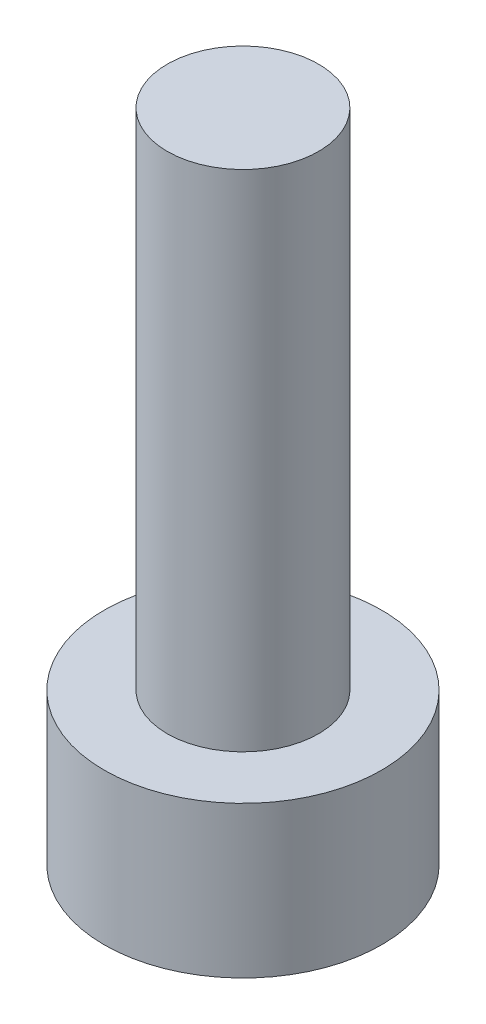
ISO-10303-21;
HEADER;
FILE_DESCRIPTION(('STEP AP214'),'2;1');
FILE_NAME('part.step','',(''),(''),'','','');
FILE_SCHEMA(('AUTOMOTIVE_DESIGN { 1 0 10303 214 1 1 1 1 }'));
ENDSEC;
DATA;
#1=APPLICATION_CONTEXT('core data for automotive mechanical design processes');
#2=APPLICATION_PROTOCOL_DEFINITION('international standard','automotive_design',2000,#1);
#3=PRODUCT_CONTEXT('',#1,'mechanical');
#4=PRODUCT('Part','Part','',(#3));
#5=PRODUCT_RELATED_PRODUCT_CATEGORY('part','',(#4));
#6=PRODUCT_DEFINITION_FORMATION('','',#4);
#7=PRODUCT_DEFINITION_CONTEXT('part definition',#1,'design');
#8=PRODUCT_DEFINITION('design','',#6,#7);
#9=PRODUCT_DEFINITION_SHAPE('','',#8);
#10=(LENGTH_UNIT() NAMED_UNIT(*) SI_UNIT(.MILLI.,.METRE.));
#11=(NAMED_UNIT(*) PLANE_ANGLE_UNIT() SI_UNIT($,.RADIAN.));
#12=(NAMED_UNIT(*) SI_UNIT($,.STERADIAN.) SOLID_ANGLE_UNIT());
#13=UNCERTAINTY_MEASURE_WITH_UNIT(LENGTH_MEASURE(1.E-05),#10,'distance_accuracy_value','');
#14=(GEOMETRIC_REPRESENTATION_CONTEXT(3) GLOBAL_UNCERTAINTY_ASSIGNED_CONTEXT((#13)) GLOBAL_UNIT_ASSIGNED_CONTEXT((#10,
#11,#12)) REPRESENTATION_CONTEXT('',''));
#15=CARTESIAN_POINT('',(0.,0.,0.));
#16=DIRECTION('',(0.,0.,1.));
#17=DIRECTION('',(1.,0.,0.));
#18=AXIS2_PLACEMENT_3D('',#15,#16,#17);
#19=CARTESIAN_POINT('',(0.,3.,0.));
#20=DIRECTION('',(0.,1.,0.));
#21=DIRECTION('',(0.,0.,1.));
#22=AXIS2_PLACEMENT_3D('',#19,#20,#21);
#23=PLANE('',#22);
#24=CARTESIAN_POINT('',(0.,3.,0.));
#25=DIRECTION('',(0.,1.,0.));
#26=DIRECTION('',(0.,0.,1.));
#27=AXIS2_PLACEMENT_3D('',#24,#25,#26);
#28=CIRCLE('',#27,2.75);
#29=CARTESIAN_POINT('',(0.,3.,2.75));
#30=VERTEX_POINT('',#29);
#31=EDGE_CURVE('E11',#30,#30,#28,.T.);
#32=ORIENTED_EDGE('',*,*,#31,.T.);
#33=EDGE_LOOP('',(#32));
#34=FACE_BOUND('',#33,.T.);
#35=CARTESIAN_POINT('',(0.,3.,0.));
#36=DIRECTION('',(0.,1.,0.));
#37=DIRECTION('',(0.,0.,1.));
#38=AXIS2_PLACEMENT_3D('',#35,#36,#37);
#39=CIRCLE('',#38,1.5);
#40=CARTESIAN_POINT('',(0.,3.,1.5));
#41=VERTEX_POINT('',#40);
#42=EDGE_CURVE('E135',#41,#41,#39,.T.);
#43=ORIENTED_EDGE('',*,*,#42,.F.);
#44=EDGE_LOOP('',(#43));
#45=FACE_BOUND('',#44,.T.);
#46=ADVANCED_FACE('F33',(#34,#45),#23,.T.);
#47=CARTESIAN_POINT('',(0.,3.,0.));
#48=DIRECTION('',(0.,-1.,0.));
#49=DIRECTION('',(0.,0.,-1.));
#50=AXIS2_PLACEMENT_3D('',#47,#48,#49);
#51=CYLINDRICAL_SURFACE('',#50,2.75);
#52=ORIENTED_EDGE('',*,*,#31,.F.);
#53=EDGE_LOOP('',(#52));
#54=FACE_BOUND('',#53,.T.);
#55=CARTESIAN_POINT('',(0.,0.,0.));
#56=DIRECTION('',(0.,1.,0.));
#57=DIRECTION('',(0.,0.,1.));
#58=AXIS2_PLACEMENT_3D('',#55,#56,#57);
#59=CIRCLE('',#58,2.75);
#60=CARTESIAN_POINT('',(0.,0.,2.75));
#61=VERTEX_POINT('',#60);
#62=EDGE_CURVE('E37',#61,#61,#59,.T.);
#63=ORIENTED_EDGE('',*,*,#62,.T.);
#64=EDGE_LOOP('',(#63));
#65=FACE_BOUND('',#64,.T.);
#66=ADVANCED_FACE('F35',(#54,#65),#51,.T.);
#67=CARTESIAN_POINT('',(0.,0.,0.));
#68=DIRECTION('',(0.,1.,0.));
#69=DIRECTION('',(0.,0.,1.));
#70=AXIS2_PLACEMENT_3D('',#67,#68,#69);
#71=PLANE('',#70);
#72=DIRECTION('',(-0.866025403784439,0.,-0.5));
#73=VECTOR('',#72,1.);
#74=CARTESIAN_POINT('',(0.,0.,1.44337567297406));
#75=LINE('',#74,#73);
#76=CARTESIAN_POINT('',(0.,0.,1.44337567297406));
#77=VERTEX_POINT('',#76);
#78=CARTESIAN_POINT('',(-1.25,0.,0.721687836487033));
#79=VERTEX_POINT('',#78);
#80=EDGE_CURVE('E122',#77,#79,#75,.T.);
#81=ORIENTED_EDGE('',*,*,#80,.F.);
#82=DIRECTION('',(-0.866025403784439,0.,0.5));
#83=VECTOR('',#82,1.);
#84=CARTESIAN_POINT('',(1.25,0.,0.721687836487032));
#85=LINE('',#84,#83);
#86=CARTESIAN_POINT('',(1.25,0.,0.721687836487032));
#87=VERTEX_POINT('',#86);
#88=EDGE_CURVE('E48',#87,#77,#85,.T.);
#89=ORIENTED_EDGE('',*,*,#88,.F.);
#90=DIRECTION('',(0.,0.,1.));
#91=VECTOR('',#90,1.);
#92=CARTESIAN_POINT('',(1.25,0.,-0.721687836487033));
#93=LINE('',#92,#91);
#94=CARTESIAN_POINT('',(1.25,0.,-0.721687836487033));
#95=VERTEX_POINT('',#94);
#96=EDGE_CURVE('E131',#95,#87,#93,.T.);
#97=ORIENTED_EDGE('',*,*,#96,.F.);
#98=DIRECTION('',(0.866025403784439,0.,0.5));
#99=VECTOR('',#98,1.);
#100=CARTESIAN_POINT('',(0.,0.,-1.44337567297406));
#101=LINE('',#100,#99);
#102=CARTESIAN_POINT('',(0.,0.,-1.44337567297406));
#103=VERTEX_POINT('',#102);
#104=EDGE_CURVE('E129',#103,#95,#101,.T.);
#105=ORIENTED_EDGE('',*,*,#104,.F.);
#106=DIRECTION('',(0.866025403784439,0.,-0.5));
#107=VECTOR('',#106,1.);
#108=CARTESIAN_POINT('',(-1.25,0.,-0.721687836487032));
#109=LINE('',#108,#107);
#110=CARTESIAN_POINT('',(-1.25,0.,-0.721687836487032));
#111=VERTEX_POINT('',#110);
#112=EDGE_CURVE('E96',#111,#103,#109,.T.);
#113=ORIENTED_EDGE('',*,*,#112,.F.);
#114=DIRECTION('',(0.,0.,-1.));
#115=VECTOR('',#114,1.);
#116=CARTESIAN_POINT('',(-1.25,0.,0.721687836487033));
#117=LINE('',#116,#115);
#118=EDGE_CURVE('E125',#79,#111,#117,.T.);
#119=ORIENTED_EDGE('',*,*,#118,.F.);
#120=EDGE_LOOP('',(#81,#89,#97,#105,#113,#119));
#121=FACE_BOUND('',#120,.T.);
#122=ORIENTED_EDGE('',*,*,#62,.F.);
#123=EDGE_LOOP('',(#122));
#124=FACE_BOUND('',#123,.T.);
#125=ADVANCED_FACE('F155',(#121,#124),#71,.F.);
#126=CARTESIAN_POINT('',(0.,13.,0.));
#127=DIRECTION('',(0.,-1.,0.));
#128=DIRECTION('',(0.,0.,-1.));
#129=AXIS2_PLACEMENT_3D('',#126,#127,#128);
#130=CYLINDRICAL_SURFACE('',#129,1.5);
#131=CARTESIAN_POINT('',(0.,13.,0.));
#132=DIRECTION('',(0.,1.,0.));
#133=DIRECTION('',(0.,0.,1.));
#134=AXIS2_PLACEMENT_3D('',#131,#132,#133);
#135=CIRCLE('',#134,1.5);
#136=CARTESIAN_POINT('',(0.,13.,1.5));
#137=VERTEX_POINT('',#136);
#138=EDGE_CURVE('E141',#137,#137,#135,.T.);
#139=ORIENTED_EDGE('',*,*,#138,.F.);
#140=EDGE_LOOP('',(#139));
#141=FACE_BOUND('',#140,.T.);
#142=ORIENTED_EDGE('',*,*,#42,.T.);
#143=EDGE_LOOP('',(#142));
#144=FACE_BOUND('',#143,.T.);
#145=ADVANCED_FACE('F147',(#141,#144),#130,.T.);
#146=CARTESIAN_POINT('',(0.,13.,0.));
#147=DIRECTION('',(0.,1.,0.));
#148=DIRECTION('',(0.,0.,1.));
#149=AXIS2_PLACEMENT_3D('',#146,#147,#148);
#150=PLANE('',#149);
#151=ORIENTED_EDGE('',*,*,#138,.T.);
#152=EDGE_LOOP('',(#151));
#153=FACE_BOUND('',#152,.T.);
#154=ADVANCED_FACE('F164',(#153),#150,.T.);
#155=CARTESIAN_POINT('',(1.25,1.5,0.721687836487032));
#156=DIRECTION('',(0.5,0.,0.866025403784439));
#157=DIRECTION('',(0.866025403784439,0.,-0.5));
#158=AXIS2_PLACEMENT_3D('',#155,#156,#157);
#159=PLANE('',#158);
#160=ORIENTED_EDGE('',*,*,#88,.T.);
#161=DIRECTION('',(0.,-1.,0.));
#162=VECTOR('',#161,1.);
#163=CARTESIAN_POINT('',(0.,1.5,1.44337567297406));
#164=LINE('',#163,#162);
#165=CARTESIAN_POINT('',(0.,1.5,1.44337567297406));
#166=VERTEX_POINT('',#165);
#167=EDGE_CURVE('E78',#166,#77,#164,.T.);
#168=ORIENTED_EDGE('',*,*,#167,.F.);
#169=DIRECTION('',(-0.866025403784439,0.,0.5));
#170=VECTOR('',#169,1.);
#171=CARTESIAN_POINT('',(1.25,1.5,0.721687836487032));
#172=LINE('',#171,#170);
#173=CARTESIAN_POINT('',(1.25,1.5,0.721687836487032));
#174=VERTEX_POINT('',#173);
#175=EDGE_CURVE('E133',#174,#166,#172,.T.);
#176=ORIENTED_EDGE('',*,*,#175,.F.);
#177=DIRECTION('',(0.,-1.,0.));
#178=VECTOR('',#177,1.);
#179=CARTESIAN_POINT('',(1.25,1.5,0.721687836487032));
#180=LINE('',#179,#178);
#181=EDGE_CURVE('E56',#174,#87,#180,.T.);
#182=ORIENTED_EDGE('',*,*,#181,.T.);
#183=EDGE_LOOP('',(#160,#168,#176,#182));
#184=FACE_BOUND('',#183,.T.);
#185=ADVANCED_FACE('F176',(#184),#159,.F.);
#186=CARTESIAN_POINT('',(1.25,1.5,-0.721687836487033));
#187=DIRECTION('',(1.,0.,0.));
#188=DIRECTION('',(0.,0.,-1.));
#189=AXIS2_PLACEMENT_3D('',#186,#187,#188);
#190=PLANE('',#189);
#191=ORIENTED_EDGE('',*,*,#96,.T.);
#192=ORIENTED_EDGE('',*,*,#181,.F.);
#193=DIRECTION('',(0.,0.,1.));
#194=VECTOR('',#193,1.);
#195=CARTESIAN_POINT('',(1.25,1.5,-0.721687836487033));
#196=LINE('',#195,#194);
#197=CARTESIAN_POINT('',(1.25,1.5,-0.721687836487033));
#198=VERTEX_POINT('',#197);
#199=EDGE_CURVE('E108',#198,#174,#196,.T.);
#200=ORIENTED_EDGE('',*,*,#199,.F.);
#201=DIRECTION('',(0.,-1.,0.));
#202=VECTOR('',#201,1.);
#203=CARTESIAN_POINT('',(1.25,1.5,-0.721687836487033));
#204=LINE('',#203,#202);
#205=EDGE_CURVE('E100',#198,#95,#204,.T.);
#206=ORIENTED_EDGE('',*,*,#205,.T.);
#207=EDGE_LOOP('',(#191,#192,#200,#206));
#208=FACE_BOUND('',#207,.T.);
#209=ADVANCED_FACE('F178',(#208),#190,.F.);
#210=CARTESIAN_POINT('',(0.,1.5,-1.44337567297406));
#211=DIRECTION('',(0.5,0.,-0.866025403784439));
#212=DIRECTION('',(-0.866025403784439,0.,-0.5));
#213=AXIS2_PLACEMENT_3D('',#210,#211,#212);
#214=PLANE('',#213);
#215=ORIENTED_EDGE('',*,*,#104,.T.);
#216=ORIENTED_EDGE('',*,*,#205,.F.);
#217=DIRECTION('',(0.866025403784439,0.,0.5));
#218=VECTOR('',#217,1.);
#219=CARTESIAN_POINT('',(0.,1.5,-1.44337567297406));
#220=LINE('',#219,#218);
#221=CARTESIAN_POINT('',(0.,1.5,-1.44337567297406));
#222=VERTEX_POINT('',#221);
#223=EDGE_CURVE('E104',#222,#198,#220,.T.);
#224=ORIENTED_EDGE('',*,*,#223,.F.);
#225=DIRECTION('',(0.,-1.,0.));
#226=VECTOR('',#225,1.);
#227=CARTESIAN_POINT('',(0.,1.5,-1.44337567297406));
#228=LINE('',#227,#226);
#229=EDGE_CURVE('E89',#222,#103,#228,.T.);
#230=ORIENTED_EDGE('',*,*,#229,.T.);
#231=EDGE_LOOP('',(#215,#216,#224,#230));
#232=FACE_BOUND('',#231,.T.);
#233=ADVANCED_FACE('F105',(#232),#214,.F.);
#234=CARTESIAN_POINT('',(-1.25,1.5,-0.721687836487032));
#235=DIRECTION('',(-0.5,0.,-0.866025403784439));
#236=DIRECTION('',(-0.866025403784439,0.,0.5));
#237=AXIS2_PLACEMENT_3D('',#234,#235,#236);
#238=PLANE('',#237);
#239=ORIENTED_EDGE('',*,*,#112,.T.);
#240=ORIENTED_EDGE('',*,*,#229,.F.);
#241=DIRECTION('',(0.866025403784439,0.,-0.5));
#242=VECTOR('',#241,1.);
#243=CARTESIAN_POINT('',(-1.25,1.5,-0.721687836487032));
#244=LINE('',#243,#242);
#245=CARTESIAN_POINT('',(-1.25,1.5,-0.721687836487032));
#246=VERTEX_POINT('',#245);
#247=EDGE_CURVE('E93',#246,#222,#244,.T.);
#248=ORIENTED_EDGE('',*,*,#247,.F.);
#249=DIRECTION('',(0.,-1.,0.));
#250=VECTOR('',#249,1.);
#251=CARTESIAN_POINT('',(-1.25,1.5,-0.721687836487032));
#252=LINE('',#251,#250);
#253=EDGE_CURVE('E101',#246,#111,#252,.T.);
#254=ORIENTED_EDGE('',*,*,#253,.T.);
#255=EDGE_LOOP('',(#239,#240,#248,#254));
#256=FACE_BOUND('',#255,.T.);
#257=ADVANCED_FACE('F91',(#256),#238,.F.);
#258=CARTESIAN_POINT('',(-1.25,1.5,0.721687836487033));
#259=DIRECTION('',(-1.,0.,0.));
#260=DIRECTION('',(0.,0.,1.));
#261=AXIS2_PLACEMENT_3D('',#258,#259,#260);
#262=PLANE('',#261);
#263=ORIENTED_EDGE('',*,*,#118,.T.);
#264=ORIENTED_EDGE('',*,*,#253,.F.);
#265=DIRECTION('',(0.,0.,-1.));
#266=VECTOR('',#265,1.);
#267=CARTESIAN_POINT('',(-1.25,1.5,0.721687836487033));
#268=LINE('',#267,#266);
#269=CARTESIAN_POINT('',(-1.25,1.5,0.721687836487033));
#270=VERTEX_POINT('',#269);
#271=EDGE_CURVE('E114',#270,#246,#268,.T.);
#272=ORIENTED_EDGE('',*,*,#271,.F.);
#273=DIRECTION('',(0.,-1.,0.));
#274=VECTOR('',#273,1.);
#275=CARTESIAN_POINT('',(-1.25,1.5,0.721687836487033));
#276=LINE('',#275,#274);
#277=EDGE_CURVE('E138',#270,#79,#276,.T.);
#278=ORIENTED_EDGE('',*,*,#277,.T.);
#279=EDGE_LOOP('',(#263,#264,#272,#278));
#280=FACE_BOUND('',#279,.T.);
#281=ADVANCED_FACE('F189',(#280),#262,.F.);
#282=CARTESIAN_POINT('',(0.,1.5,1.44337567297406));
#283=DIRECTION('',(-0.5,0.,0.866025403784439));
#284=DIRECTION('',(0.866025403784439,0.,0.5));
#285=AXIS2_PLACEMENT_3D('',#282,#283,#284);
#286=PLANE('',#285);
#287=ORIENTED_EDGE('',*,*,#80,.T.);
#288=ORIENTED_EDGE('',*,*,#277,.F.);
#289=DIRECTION('',(-0.866025403784439,0.,-0.5));
#290=VECTOR('',#289,1.);
#291=CARTESIAN_POINT('',(0.,1.5,1.44337567297406));
#292=LINE('',#291,#290);
#293=EDGE_CURVE('E116',#166,#270,#292,.T.);
#294=ORIENTED_EDGE('',*,*,#293,.F.);
#295=ORIENTED_EDGE('',*,*,#167,.T.);
#296=EDGE_LOOP('',(#287,#288,#294,#295));
#297=FACE_BOUND('',#296,.T.);
#298=ADVANCED_FACE('F174',(#297),#286,.F.);
#299=CARTESIAN_POINT('',(0.,1.5,0.));
#300=DIRECTION('',(0.,-1.,0.));
#301=DIRECTION('',(0.,0.,-1.));
#302=AXIS2_PLACEMENT_3D('',#299,#300,#301);
#303=PLANE('',#302);
#304=ORIENTED_EDGE('',*,*,#175,.T.);
#305=ORIENTED_EDGE('',*,*,#293,.T.);
#306=ORIENTED_EDGE('',*,*,#271,.T.);
#307=ORIENTED_EDGE('',*,*,#247,.T.);
#308=ORIENTED_EDGE('',*,*,#223,.T.);
#309=ORIENTED_EDGE('',*,*,#199,.T.);
#310=EDGE_LOOP('',(#304,#305,#306,#307,#308,#309));
#311=FACE_BOUND('',#310,.T.);
#312=ADVANCED_FACE('F111',(#311),#303,.T.);
#313=CLOSED_SHELL('',(#46,#66,#125,#145,#154,#185,#209,#233,#257,#281,#298,#312));
#314=MANIFOLD_SOLID_BREP('B2',#313);
#315=ADVANCED_BREP_SHAPE_REPRESENTATION('',(#18,#314),#14);
#316=SHAPE_DEFINITION_REPRESENTATION(#9,#315);
ENDSEC;
END-ISO-10303-21;
